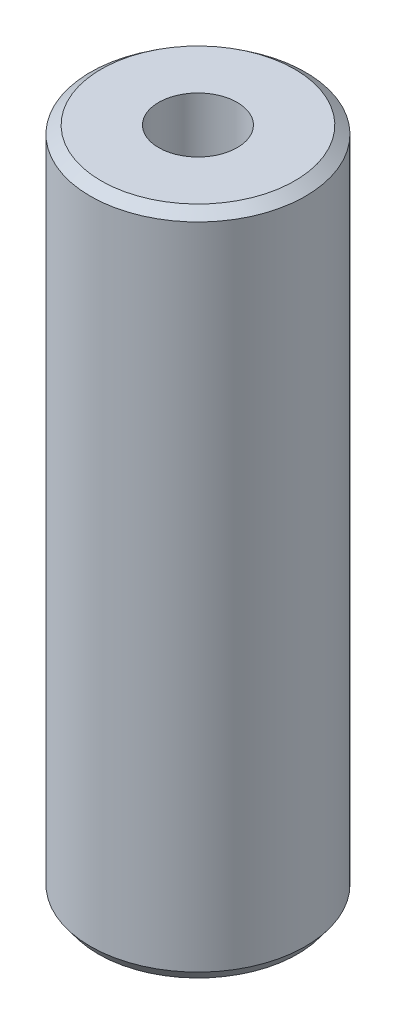
ISO-10303-21;
HEADER;
FILE_DESCRIPTION(('STEP AP214'),'2;1');
FILE_NAME('part.step','',(''),(''),'','','');
FILE_SCHEMA(('AUTOMOTIVE_DESIGN { 1 0 10303 214 1 1 1 1 }'));
ENDSEC;
DATA;
#1=APPLICATION_CONTEXT('core data for automotive mechanical design processes');
#2=APPLICATION_PROTOCOL_DEFINITION('international standard','automotive_design',2000,#1);
#3=PRODUCT_CONTEXT('',#1,'mechanical');
#4=PRODUCT('Part','Part','',(#3));
#5=PRODUCT_RELATED_PRODUCT_CATEGORY('part','',(#4));
#6=PRODUCT_DEFINITION_FORMATION('','',#4);
#7=PRODUCT_DEFINITION_CONTEXT('part definition',#1,'design');
#8=PRODUCT_DEFINITION('design','',#6,#7);
#9=PRODUCT_DEFINITION_SHAPE('','',#8);
#10=(LENGTH_UNIT() NAMED_UNIT(*) SI_UNIT(.MILLI.,.METRE.));
#11=(NAMED_UNIT(*) PLANE_ANGLE_UNIT() SI_UNIT($,.RADIAN.));
#12=(NAMED_UNIT(*) SI_UNIT($,.STERADIAN.) SOLID_ANGLE_UNIT());
#13=UNCERTAINTY_MEASURE_WITH_UNIT(LENGTH_MEASURE(1.E-05),#10,'distance_accuracy_value','');
#14=(GEOMETRIC_REPRESENTATION_CONTEXT(3) GLOBAL_UNCERTAINTY_ASSIGNED_CONTEXT((#13)) GLOBAL_UNIT_ASSIGNED_CONTEXT((#10,
#11,#12)) REPRESENTATION_CONTEXT('',''));
#15=CARTESIAN_POINT('',(0.,0.,0.));
#16=DIRECTION('',(0.,0.,1.));
#17=DIRECTION('',(1.,0.,0.));
#18=AXIS2_PLACEMENT_3D('',#15,#16,#17);
#19=CARTESIAN_POINT('',(0.,326.358720242989,0.));
#20=DIRECTION('',(0.,-1.,0.));
#21=DIRECTION('',(0.,0.,-1.));
#22=AXIS2_PLACEMENT_3D('',#19,#20,#21);
#23=CYLINDRICAL_SURFACE('',#22,52.5);
#24=CARTESIAN_POINT('',(0.,322.467250717641,0.));
#25=DIRECTION('',(0.,1.,0.));
#26=DIRECTION('',(0.,0.,1.));
#27=AXIS2_PLACEMENT_3D('',#24,#25,#26);
#28=CIRCLE('',#27,52.5);
#29=CARTESIAN_POINT('',(0.,322.467250717641,52.5));
#30=VERTEX_POINT('',#29);
#31=EDGE_CURVE('E50',#30,#30,#28,.F.);
#32=ORIENTED_EDGE('',*,*,#31,.T.);
#33=EDGE_LOOP('',(#32));
#34=FACE_BOUND('',#33,.T.);
#35=CARTESIAN_POINT('',(0.,5.23243072768626,0.));
#36=DIRECTION('',(0.,1.,0.));
#37=DIRECTION('',(0.,0.,1.));
#38=AXIS2_PLACEMENT_3D('',#35,#36,#37);
#39=CIRCLE('',#38,52.5);
#40=CARTESIAN_POINT('',(0.,5.23243072768625,52.5));
#41=VERTEX_POINT('',#40);
#42=EDGE_CURVE('E51',#41,#41,#39,.T.);
#43=ORIENTED_EDGE('',*,*,#42,.T.);
#44=EDGE_LOOP('',(#43));
#45=FACE_BOUND('',#44,.T.);
#46=ADVANCED_FACE('F39',(#34,#45),#23,.T.);
#47=CARTESIAN_POINT('',(0.,326.358720242989,0.));
#48=DIRECTION('',(0.,1.,0.));
#49=DIRECTION('',(0.,0.,1.));
#50=AXIS2_PLACEMENT_3D('',#47,#48,#49);
#51=PLANE('',#50);
#52=CARTESIAN_POINT('',(0.,326.358720242989,0.));
#53=DIRECTION('',(0.,1.,0.));
#54=DIRECTION('',(0.,0.,1.));
#55=AXIS2_PLACEMENT_3D('',#52,#53,#54);
#56=CIRCLE('',#55,47.2675692723138);
#57=CARTESIAN_POINT('',(0.,326.358720242989,47.2675692723138));
#58=VERTEX_POINT('',#57);
#59=EDGE_CURVE('E54',#58,#58,#56,.T.);
#60=ORIENTED_EDGE('',*,*,#59,.T.);
#61=EDGE_LOOP('',(#60));
#62=FACE_BOUND('',#61,.T.);
#63=CARTESIAN_POINT('',(0.,326.358720242989,0.));
#64=DIRECTION('',(0.,1.,0.));
#65=DIRECTION('',(0.,0.,1.));
#66=AXIS2_PLACEMENT_3D('',#63,#64,#65);
#67=CIRCLE('',#66,19.1741311042541);
#68=CARTESIAN_POINT('',(0.,326.358720242989,19.1741311042541));
#69=VERTEX_POINT('',#68);
#70=EDGE_CURVE('E58',#69,#69,#67,.T.);
#71=ORIENTED_EDGE('',*,*,#70,.F.);
#72=EDGE_LOOP('',(#71));
#73=FACE_BOUND('',#72,.T.);
#74=ADVANCED_FACE('F69',(#62,#73),#51,.T.);
#75=CARTESIAN_POINT('',(0.,0.,0.));
#76=DIRECTION('',(0.,1.,0.));
#77=DIRECTION('',(0.,0.,1.));
#78=AXIS2_PLACEMENT_3D('',#75,#76,#77);
#79=PLANE('',#78);
#80=CARTESIAN_POINT('',(0.,0.,0.));
#81=DIRECTION('',(0.,1.,0.));
#82=DIRECTION('',(0.,0.,1.));
#83=AXIS2_PLACEMENT_3D('',#80,#81,#82);
#84=CIRCLE('',#83,48.6085304746521);
#85=CARTESIAN_POINT('',(0.,0.,48.6085304746521));
#86=VERTEX_POINT('',#85);
#87=EDGE_CURVE('E10',#86,#86,#84,.F.);
#88=ORIENTED_EDGE('',*,*,#87,.T.);
#89=EDGE_LOOP('',(#88));
#90=FACE_BOUND('',#89,.T.);
#91=CARTESIAN_POINT('',(0.,0.,0.));
#92=DIRECTION('',(0.,1.,0.));
#93=DIRECTION('',(0.,0.,1.));
#94=AXIS2_PLACEMENT_3D('',#91,#92,#93);
#95=CIRCLE('',#94,19.1741311042541);
#96=CARTESIAN_POINT('',(0.,0.,19.1741311042541));
#97=VERTEX_POINT('',#96);
#98=EDGE_CURVE('E63',#97,#97,#95,.T.);
#99=ORIENTED_EDGE('',*,*,#98,.T.);
#100=EDGE_LOOP('',(#99));
#101=FACE_BOUND('',#100,.T.);
#102=ADVANCED_FACE('F75',(#90,#101),#79,.F.);
#103=CARTESIAN_POINT('',(0.,326.358720242989,0.));
#104=DIRECTION('',(0.,-1.,0.));
#105=DIRECTION('',(0.,0.,-1.));
#106=AXIS2_PLACEMENT_3D('',#103,#104,#105);
#107=CYLINDRICAL_SURFACE('',#106,19.1741311042541);
#108=ORIENTED_EDGE('',*,*,#70,.T.);
#109=EDGE_LOOP('',(#108));
#110=FACE_BOUND('',#109,.T.);
#111=ORIENTED_EDGE('',*,*,#98,.F.);
#112=EDGE_LOOP('',(#111));
#113=FACE_BOUND('',#112,.T.);
#114=ADVANCED_FACE('F70',(#110,#113),#107,.F.);
#115=CARTESIAN_POINT('',(0.,326.358720242989,0.));
#116=DIRECTION('',(0.,-1.,0.));
#117=DIRECTION('',(0.,0.,-1.));
#118=AXIS2_PLACEMENT_3D('',#115,#116,#117);
#119=CONICAL_SURFACE('',#118,47.2675692723138,0.931325792166396);
#120=ORIENTED_EDGE('',*,*,#31,.F.);
#121=EDGE_LOOP('',(#120));
#122=FACE_BOUND('',#121,.T.);
#123=ORIENTED_EDGE('',*,*,#59,.F.);
#124=EDGE_LOOP('',(#123));
#125=FACE_BOUND('',#124,.T.);
#126=ADVANCED_FACE('F81',(#122,#125),#119,.T.);
#127=CARTESIAN_POINT('',(0.,5.23243072768626,0.));
#128=DIRECTION('',(0.,1.,0.));
#129=DIRECTION('',(0.,0.,1.));
#130=AXIS2_PLACEMENT_3D('',#127,#128,#129);
#131=CONICAL_SURFACE('',#130,52.5,0.639470534628495);
#132=CARTESIAN_POINT('',(0.,0.,48.6085304746521));
#133=CARTESIAN_POINT('',(0.,0.0545044867467325,48.6490666155411));
#134=CARTESIAN_POINT('',(0.,0.109008973493464,48.6896027564302));
#135=CARTESIAN_POINT('',(0.,0.218017946986926,48.7706750382083));
#136=CARTESIAN_POINT('',(0.,0.272522433733658,48.8112111790973));
#137=CARTESIAN_POINT('',(0.,0.381531407227121,48.8922834608754));
#138=CARTESIAN_POINT('',(0.,0.436035893973853,48.9328196017644));
#139=CARTESIAN_POINT('',(0.,0.545044867467318,49.0138918835425));
#140=CARTESIAN_POINT('',(0.,0.59954935421405,49.0544280244316));
#141=CARTESIAN_POINT('',(0.,0.708558327707513,49.1355003062096));
#142=CARTESIAN_POINT('',(0.,0.763062814454244,49.1760364470987));
#143=CARTESIAN_POINT('',(0.,0.872071787947708,49.2571087288768));
#144=CARTESIAN_POINT('',(0.,0.926576274694441,49.2976448697658));
#145=CARTESIAN_POINT('',(0.,1.0355852481879,49.3787171515439));
#146=CARTESIAN_POINT('',(0.,1.09008973493464,49.4192532924329));
#147=CARTESIAN_POINT('',(0.,1.1990987084281,49.500325574211));
#148=CARTESIAN_POINT('',(0.,1.25360319517483,49.5408617151));
#149=CARTESIAN_POINT('',(0.,1.36261216866829,49.6219339968781));
#150=CARTESIAN_POINT('',(0.,1.41711665541503,49.6624701377672));
#151=CARTESIAN_POINT('',(0.,1.52612562890849,49.7435424195452));
#152=CARTESIAN_POINT('',(0.,1.58063011565522,49.7840785604343));
#153=CARTESIAN_POINT('',(0.,1.68963908914868,49.8651508422124));
#154=CARTESIAN_POINT('',(0.,1.74414357589542,49.9056869831014));
#155=CARTESIAN_POINT('',(0.,1.85315254938888,49.9867592648795));
#156=CARTESIAN_POINT('',(0.,1.90765703613561,50.0272954057685));
#157=CARTESIAN_POINT('',(0.,2.01666600962908,50.1083676875466));
#158=CARTESIAN_POINT('',(0.,2.07117049637581,50.1489038284356));
#159=CARTESIAN_POINT('',(0.,2.18017946986927,50.2299761102137));
#160=CARTESIAN_POINT('',(0.,2.234683956616,50.2705122511028));
#161=CARTESIAN_POINT('',(0.,2.34369293010947,50.3515845328808));
#162=CARTESIAN_POINT('',(0.,2.3981974168562,50.3921206737699));
#163=CARTESIAN_POINT('',(0.,2.50720639034966,50.473192955548));
#164=CARTESIAN_POINT('',(0.,2.5617108770964,50.513729096437));
#165=CARTESIAN_POINT('',(0.,2.67071985058986,50.5948013782151));
#166=CARTESIAN_POINT('',(0.,2.72522433733659,50.6353375191041));
#167=CARTESIAN_POINT('',(0.,2.83423331083005,50.7164098008822));
#168=CARTESIAN_POINT('',(0.,2.88873779757679,50.7569459417713));
#169=CARTESIAN_POINT('',(0.,2.99774677107025,50.8380182235493));
#170=CARTESIAN_POINT('',(0.,3.05225125781698,50.8785543644384));
#171=CARTESIAN_POINT('',(0.,3.16126023131044,50.9596266462165));
#172=CARTESIAN_POINT('',(0.,3.21576471805718,51.0001627871055));
#173=CARTESIAN_POINT('',(0.,3.32477369155064,51.0812350688836));
#174=CARTESIAN_POINT('',(0.,3.37927817829737,51.1217712097726));
#175=CARTESIAN_POINT('',(0.,3.48828715179084,51.2028434915507));
#176=CARTESIAN_POINT('',(0.,3.54279163853757,51.2433796324397));
#177=CARTESIAN_POINT('',(0.,3.65180061203103,51.3244519142178));
#178=CARTESIAN_POINT('',(0.,3.70630509877776,51.3649880551069));
#179=CARTESIAN_POINT('',(0.,3.81531407227123,51.4460603368849));
#180=CARTESIAN_POINT('',(0.,3.86981855901796,51.486596477774));
#181=CARTESIAN_POINT('',(0.,3.97882753251142,51.5676687595521));
#182=CARTESIAN_POINT('',(0.,4.03333201925815,51.6082049004411));
#183=CARTESIAN_POINT('',(0.,4.14234099275162,51.6892771822192));
#184=CARTESIAN_POINT('',(0.,4.19684547949835,51.7298133231082));
#185=CARTESIAN_POINT('',(0.,4.30585445299181,51.8108856048863));
#186=CARTESIAN_POINT('',(0.,4.36035893973854,51.8514217457753));
#187=CARTESIAN_POINT('',(0.,4.46936791323201,51.9324940275534));
#188=CARTESIAN_POINT('',(0.,4.52387239997874,51.9730301684425));
#189=CARTESIAN_POINT('',(0.,4.6328813734722,52.0541024502206));
#190=CARTESIAN_POINT('',(0.,4.68738586021894,52.0946385911096));
#191=CARTESIAN_POINT('',(0.,4.7963948337124,52.1757108728877));
#192=CARTESIAN_POINT('',(0.,4.85089932045913,52.2162470137767));
#193=CARTESIAN_POINT('',(0.,4.9599082939526,52.2973192955548));
#194=CARTESIAN_POINT('',(0.,5.01441278069933,52.3378554364438));
#195=CARTESIAN_POINT('',(0.,5.12342175419279,52.4189277182219));
#196=CARTESIAN_POINT('',(0.,5.17792624093952,52.459463859111));
#197=CARTESIAN_POINT('',(0.,5.23243072768625,52.5));
#198=B_SPLINE_CURVE_WITH_KNOTS('',3,(#132,#133,#134,#135,#136,#137,#138,#139,#140,#141,#142,
#143,#144,#145,#146,#147,#148,#149,#150,#151,#152,#153,#154,#155,#156,#157,#158,#159,#160,#161,
#162,#163,#164,#165,#166,#167,#168,#169,#170,#171,#172,#173,#174,#175,#176,#177,#178,#179,#180,
#181,#182,#183,#184,#185,#186,#187,#188,#189,#190,#191,#192,#193,#194,#195,#196,#197),
.UNSPECIFIED.,.F.,.F.,(4,2,2,2,2,2,2,2,2,2,2,2,2,2,2,2,2,2,2,2,2,2,2,2,2,2,2,2,2,2,2,2,4),(0.,
0.203777477026551,0.407554954053106,0.611332431079658,0.815109908106209,1.01888738513276,
1.22266486215932,1.42644233918587,1.63021981621242,1.83399729323897,2.03777477026553,
2.24155224729208,2.44532972431863,2.64910720134519,2.85288467837174,3.05666215539829,
3.26043963242484,3.4642171094514,3.66799458647795,3.8717720635045,4.07554954053106,
4.27932701755761,4.48310449458416,4.68688197161071,4.89065944863727,5.09443692566382,
5.29821440269037,5.50199187971693,5.70576935674348,5.90954683377003,6.11332431079659,
6.31710178782314,6.52087926484969),.UNSPECIFIED.);
#199=EDGE_CURVE('BSEAM45',#86,#41,#198,.T.);
#200=ORIENTED_EDGE('',*,*,#87,.F.);
#201=ORIENTED_EDGE('',*,*,#42,.F.);
#202=ORIENTED_EDGE('',*,*,#199,.T.);
#203=ORIENTED_EDGE('',*,*,#199,.F.);
#204=EDGE_LOOP('',(#200,#202,#201,#203));
#205=FACE_BOUND('',#204,.T.);
#206=ADVANCED_FACE('F45',(#205),#131,.T.);
#207=CLOSED_SHELL('',(#46,#74,#102,#114,#126,#206));
#208=MANIFOLD_SOLID_BREP('B2',#207);
#209=ADVANCED_BREP_SHAPE_REPRESENTATION('',(#18,#208),#14);
#210=SHAPE_DEFINITION_REPRESENTATION(#9,#209);
ENDSEC;
END-ISO-10303-21;
